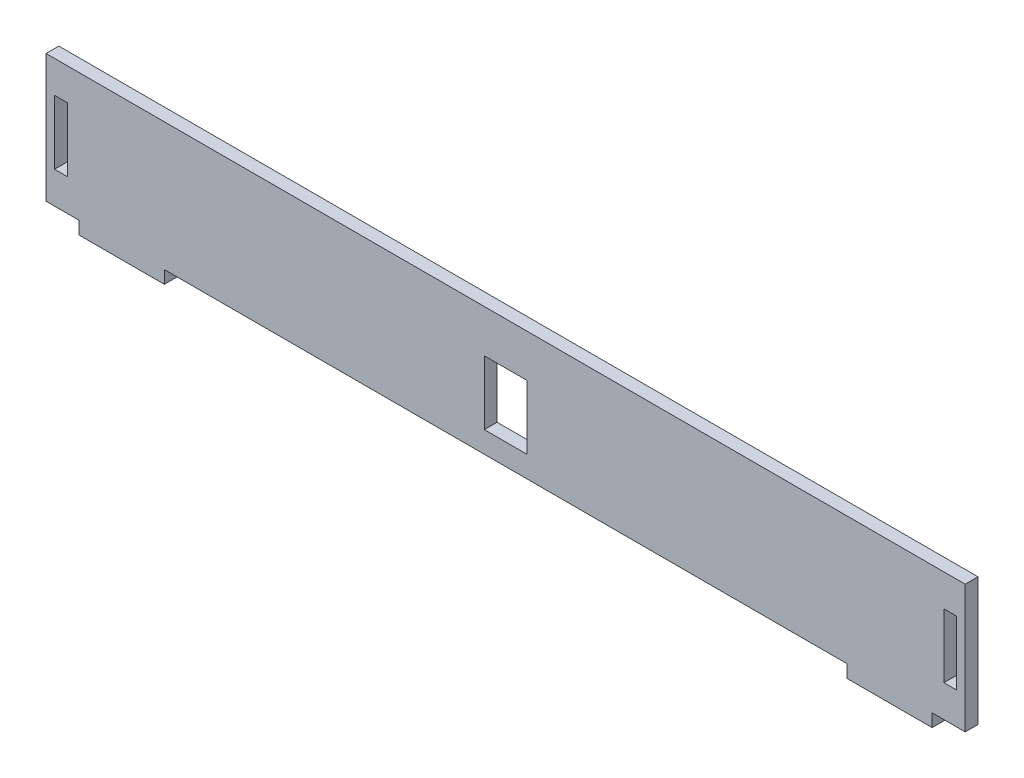
ISO-10303-21;
HEADER;
FILE_DESCRIPTION(('STEP AP214'),'2;1');
FILE_NAME('part.step','',(''),(''),'','','');
FILE_SCHEMA(('AUTOMOTIVE_DESIGN { 1 0 10303 214 1 1 1 1 }'));
ENDSEC;
DATA;
#1=APPLICATION_CONTEXT('core data for automotive mechanical design processes');
#2=APPLICATION_PROTOCOL_DEFINITION('international standard','automotive_design',2000,#1);
#3=PRODUCT_CONTEXT('',#1,'mechanical');
#4=PRODUCT('Part','Part','',(#3));
#5=PRODUCT_RELATED_PRODUCT_CATEGORY('part','',(#4));
#6=PRODUCT_DEFINITION_FORMATION('','',#4);
#7=PRODUCT_DEFINITION_CONTEXT('part definition',#1,'design');
#8=PRODUCT_DEFINITION('design','',#6,#7);
#9=PRODUCT_DEFINITION_SHAPE('','',#8);
#10=(LENGTH_UNIT() NAMED_UNIT(*) SI_UNIT(.MILLI.,.METRE.));
#11=(NAMED_UNIT(*) PLANE_ANGLE_UNIT() SI_UNIT($,.RADIAN.));
#12=(NAMED_UNIT(*) SI_UNIT($,.STERADIAN.) SOLID_ANGLE_UNIT());
#13=UNCERTAINTY_MEASURE_WITH_UNIT(LENGTH_MEASURE(1.E-05),#10,'distance_accuracy_value','');
#14=(GEOMETRIC_REPRESENTATION_CONTEXT(3) GLOBAL_UNCERTAINTY_ASSIGNED_CONTEXT((#13)) GLOBAL_UNIT_ASSIGNED_CONTEXT((#10,
#11,#12)) REPRESENTATION_CONTEXT('',''));
#15=CARTESIAN_POINT('',(0.,0.,0.));
#16=DIRECTION('',(0.,0.,1.));
#17=DIRECTION('',(1.,0.,0.));
#18=AXIS2_PLACEMENT_3D('',#15,#16,#17);
#19=CARTESIAN_POINT('',(0.,0.,3.));
#20=DIRECTION('',(0.,0.,1.));
#21=DIRECTION('',(1.,0.,0.));
#22=AXIS2_PLACEMENT_3D('',#19,#20,#21);
#23=PLANE('',#22);
#24=DIRECTION('',(1.,0.,0.));
#25=VECTOR('',#24,1.);
#26=CARTESIAN_POINT('',(0.,0.,3.));
#27=LINE('',#26,#25);
#28=CARTESIAN_POINT('',(-7.75,0.,3.));
#29=VERTEX_POINT('',#28);
#30=CARTESIAN_POINT('',(0.,0.,3.));
#31=VERTEX_POINT('',#30);
#32=EDGE_CURVE('E335',#29,#31,#27,.T.);
#33=ORIENTED_EDGE('',*,*,#32,.T.);
#34=DIRECTION('',(0.,-1.,0.));
#35=VECTOR('',#34,1.);
#36=CARTESIAN_POINT('',(0.,0.,3.));
#37=LINE('',#36,#35);
#38=CARTESIAN_POINT('',(0.,-3.,3.));
#39=VERTEX_POINT('',#38);
#40=EDGE_CURVE('E339',#31,#39,#37,.T.);
#41=ORIENTED_EDGE('',*,*,#40,.T.);
#42=DIRECTION('',(1.,0.,0.));
#43=VECTOR('',#42,1.);
#44=CARTESIAN_POINT('',(0.,-3.,3.));
#45=LINE('',#44,#43);
#46=CARTESIAN_POINT('',(20.,-3.,3.));
#47=VERTEX_POINT('',#46);
#48=EDGE_CURVE('E343',#39,#47,#45,.T.);
#49=ORIENTED_EDGE('',*,*,#48,.T.);
#50=DIRECTION('',(0.,1.,0.));
#51=VECTOR('',#50,1.);
#52=CARTESIAN_POINT('',(20.,0.,3.));
#53=LINE('',#52,#51);
#54=CARTESIAN_POINT('',(20.,0.,3.));
#55=VERTEX_POINT('',#54);
#56=EDGE_CURVE('E346',#47,#55,#53,.T.);
#57=ORIENTED_EDGE('',*,*,#56,.T.);
#58=DIRECTION('',(1.,0.,0.));
#59=VECTOR('',#58,1.);
#60=CARTESIAN_POINT('',(20.,0.,3.));
#61=LINE('',#60,#59);
#62=CARTESIAN_POINT('',(180.,0.,3.));
#63=VERTEX_POINT('',#62);
#64=EDGE_CURVE('E349',#55,#63,#61,.T.);
#65=ORIENTED_EDGE('',*,*,#64,.T.);
#66=DIRECTION('',(0.,-1.,0.));
#67=VECTOR('',#66,1.);
#68=CARTESIAN_POINT('',(180.,0.,3.));
#69=LINE('',#68,#67);
#70=CARTESIAN_POINT('',(180.,-3.,3.));
#71=VERTEX_POINT('',#70);
#72=EDGE_CURVE('E352',#63,#71,#69,.T.);
#73=ORIENTED_EDGE('',*,*,#72,.T.);
#74=DIRECTION('',(1.,0.,0.));
#75=VECTOR('',#74,1.);
#76=CARTESIAN_POINT('',(200.,-3.,3.));
#77=LINE('',#76,#75);
#78=CARTESIAN_POINT('',(200.,-3.,3.));
#79=VERTEX_POINT('',#78);
#80=EDGE_CURVE('E355',#71,#79,#77,.T.);
#81=ORIENTED_EDGE('',*,*,#80,.T.);
#82=DIRECTION('',(0.,1.,0.));
#83=VECTOR('',#82,1.);
#84=CARTESIAN_POINT('',(200.,0.,3.));
#85=LINE('',#84,#83);
#86=CARTESIAN_POINT('',(200.,0.,3.));
#87=VERTEX_POINT('',#86);
#88=EDGE_CURVE('E358',#79,#87,#85,.T.);
#89=ORIENTED_EDGE('',*,*,#88,.T.);
#90=DIRECTION('',(1.,0.,0.));
#91=VECTOR('',#90,1.);
#92=CARTESIAN_POINT('',(200.,0.,3.));
#93=LINE('',#92,#91);
#94=CARTESIAN_POINT('',(207.75,0.,3.));
#95=VERTEX_POINT('',#94);
#96=EDGE_CURVE('E361',#87,#95,#93,.T.);
#97=ORIENTED_EDGE('',*,*,#96,.T.);
#98=DIRECTION('',(0.,1.,0.));
#99=VECTOR('',#98,1.);
#100=CARTESIAN_POINT('',(207.75,30.,3.));
#101=LINE('',#100,#99);
#102=CARTESIAN_POINT('',(207.75,30.,3.));
#103=VERTEX_POINT('',#102);
#104=EDGE_CURVE('E364',#95,#103,#101,.T.);
#105=ORIENTED_EDGE('',*,*,#104,.T.);
#106=DIRECTION('',(-1.,0.,0.));
#107=VECTOR('',#106,1.);
#108=CARTESIAN_POINT('',(202.75,30.,3.));
#109=LINE('',#108,#107);
#110=CARTESIAN_POINT('',(-7.75,30.,3.));
#111=VERTEX_POINT('',#110);
#112=EDGE_CURVE('E367',#103,#111,#109,.T.);
#113=ORIENTED_EDGE('',*,*,#112,.T.);
#114=DIRECTION('',(0.,-1.,0.));
#115=VECTOR('',#114,1.);
#116=CARTESIAN_POINT('',(-7.75,30.,3.));
#117=LINE('',#116,#115);
#118=EDGE_CURVE('E370',#111,#29,#117,.T.);
#119=ORIENTED_EDGE('',*,*,#118,.T.);
#120=EDGE_LOOP('',(#33,#41,#49,#57,#65,#73,#81,#89,#97,#105,#113,#119));
#121=FACE_BOUND('',#120,.T.);
#122=DIRECTION('',(0.,-1.,0.));
#123=VECTOR('',#122,1.);
#124=CARTESIAN_POINT('',(202.75,22.5,3.));
#125=LINE('',#124,#123);
#126=CARTESIAN_POINT('',(202.75,22.5,3.));
#127=VERTEX_POINT('',#126);
#128=CARTESIAN_POINT('',(202.75,7.5,3.));
#129=VERTEX_POINT('',#128);
#130=EDGE_CURVE('E295',#127,#129,#125,.T.);
#131=ORIENTED_EDGE('',*,*,#130,.F.);
#132=DIRECTION('',(-1.,0.,0.));
#133=VECTOR('',#132,1.);
#134=CARTESIAN_POINT('',(202.75,22.5,3.));
#135=LINE('',#134,#133);
#136=CARTESIAN_POINT('',(205.75,22.5,3.));
#137=VERTEX_POINT('',#136);
#138=EDGE_CURVE('E292',#137,#127,#135,.T.);
#139=ORIENTED_EDGE('',*,*,#138,.F.);
#140=DIRECTION('',(0.,1.,0.));
#141=VECTOR('',#140,1.);
#142=CARTESIAN_POINT('',(205.75,22.5,3.));
#143=LINE('',#142,#141);
#144=CARTESIAN_POINT('',(205.75,7.5,3.));
#145=VERTEX_POINT('',#144);
#146=EDGE_CURVE('E303',#145,#137,#143,.T.);
#147=ORIENTED_EDGE('',*,*,#146,.F.);
#148=DIRECTION('',(1.,0.,0.));
#149=VECTOR('',#148,1.);
#150=CARTESIAN_POINT('',(205.75,7.5,3.));
#151=LINE('',#150,#149);
#152=EDGE_CURVE('E299',#129,#145,#151,.T.);
#153=ORIENTED_EDGE('',*,*,#152,.F.);
#154=EDGE_LOOP('',(#131,#139,#147,#153));
#155=FACE_BOUND('',#154,.T.);
#156=DIRECTION('',(0.,-1.,0.));
#157=VECTOR('',#156,1.);
#158=CARTESIAN_POINT('',(-5.75,22.5,3.));
#159=LINE('',#158,#157);
#160=CARTESIAN_POINT('',(-5.75,22.5,3.));
#161=VERTEX_POINT('',#160);
#162=CARTESIAN_POINT('',(-5.75,7.5,3.));
#163=VERTEX_POINT('',#162);
#164=EDGE_CURVE('E252',#161,#163,#159,.T.);
#165=ORIENTED_EDGE('',*,*,#164,.F.);
#166=DIRECTION('',(-1.,0.,0.));
#167=VECTOR('',#166,1.);
#168=CARTESIAN_POINT('',(-2.75,22.5,3.));
#169=LINE('',#168,#167);
#170=CARTESIAN_POINT('',(-2.75,22.5,3.));
#171=VERTEX_POINT('',#170);
#172=EDGE_CURVE('E249',#171,#161,#169,.T.);
#173=ORIENTED_EDGE('',*,*,#172,.F.);
#174=DIRECTION('',(0.,1.,0.));
#175=VECTOR('',#174,1.);
#176=CARTESIAN_POINT('',(-2.75,22.5,3.));
#177=LINE('',#176,#175);
#178=CARTESIAN_POINT('',(-2.75,7.5,3.));
#179=VERTEX_POINT('',#178);
#180=EDGE_CURVE('E260',#179,#171,#177,.T.);
#181=ORIENTED_EDGE('',*,*,#180,.F.);
#182=DIRECTION('',(1.,0.,0.));
#183=VECTOR('',#182,1.);
#184=CARTESIAN_POINT('',(-5.75,7.5,3.));
#185=LINE('',#184,#183);
#186=EDGE_CURVE('E256',#163,#179,#185,.T.);
#187=ORIENTED_EDGE('',*,*,#186,.F.);
#188=EDGE_LOOP('',(#165,#173,#181,#187));
#189=FACE_BOUND('',#188,.T.);
#190=DIRECTION('',(0.,1.,0.));
#191=VECTOR('',#190,1.);
#192=CARTESIAN_POINT('',(105.,5.,3.));
#193=LINE('',#192,#191);
#194=CARTESIAN_POINT('',(105.,5.,3.));
#195=VERTEX_POINT('',#194);
#196=CARTESIAN_POINT('',(105.,20.,3.));
#197=VERTEX_POINT('',#196);
#198=EDGE_CURVE('E208',#195,#197,#193,.T.);
#199=ORIENTED_EDGE('',*,*,#198,.F.);
#200=DIRECTION('',(1.,0.,0.));
#201=VECTOR('',#200,1.);
#202=CARTESIAN_POINT('',(95.,5.,3.));
#203=LINE('',#202,#201);
#204=CARTESIAN_POINT('',(95.,5.,3.));
#205=VERTEX_POINT('',#204);
#206=EDGE_CURVE('E199',#205,#195,#203,.T.);
#207=ORIENTED_EDGE('',*,*,#206,.F.);
#208=DIRECTION('',(0.,-1.,0.));
#209=VECTOR('',#208,1.);
#210=CARTESIAN_POINT('',(95.,20.,3.));
#211=LINE('',#210,#209);
#212=CARTESIAN_POINT('',(95.,20.,3.));
#213=VERTEX_POINT('',#212);
#214=EDGE_CURVE('E226',#213,#205,#211,.T.);
#215=ORIENTED_EDGE('',*,*,#214,.F.);
#216=DIRECTION('',(-1.,0.,0.));
#217=VECTOR('',#216,1.);
#218=CARTESIAN_POINT('',(105.,20.,3.));
#219=LINE('',#218,#217);
#220=EDGE_CURVE('E222',#197,#213,#219,.T.);
#221=ORIENTED_EDGE('',*,*,#220,.F.);
#222=EDGE_LOOP('',(#199,#207,#215,#221));
#223=FACE_BOUND('',#222,.T.);
#224=ADVANCED_FACE('F39',(#121,#155,#189,#223),#23,.T.);
#225=CARTESIAN_POINT('',(0.,0.,0.));
#226=DIRECTION('',(0.,0.,1.));
#227=DIRECTION('',(1.,0.,0.));
#228=AXIS2_PLACEMENT_3D('',#225,#226,#227);
#229=PLANE('',#228);
#230=DIRECTION('',(-1.,0.,0.));
#231=VECTOR('',#230,1.);
#232=CARTESIAN_POINT('',(-2.75,22.5,0.));
#233=LINE('',#232,#231);
#234=CARTESIAN_POINT('',(-2.75,22.5,0.));
#235=VERTEX_POINT('',#234);
#236=CARTESIAN_POINT('',(-5.75,22.5,0.));
#237=VERTEX_POINT('',#236);
#238=EDGE_CURVE('E218',#235,#237,#233,.T.);
#239=ORIENTED_EDGE('',*,*,#238,.T.);
#240=DIRECTION('',(0.,-1.,0.));
#241=VECTOR('',#240,1.);
#242=CARTESIAN_POINT('',(-5.75,22.5,0.));
#243=LINE('',#242,#241);
#244=CARTESIAN_POINT('',(-5.75,7.5,0.));
#245=VERTEX_POINT('',#244);
#246=EDGE_CURVE('E267',#237,#245,#243,.T.);
#247=ORIENTED_EDGE('',*,*,#246,.T.);
#248=DIRECTION('',(1.,0.,0.));
#249=VECTOR('',#248,1.);
#250=CARTESIAN_POINT('',(-5.75,7.5,0.));
#251=LINE('',#250,#249);
#252=CARTESIAN_POINT('',(-2.75,7.5,0.));
#253=VERTEX_POINT('',#252);
#254=EDGE_CURVE('E271',#245,#253,#251,.T.);
#255=ORIENTED_EDGE('',*,*,#254,.T.);
#256=DIRECTION('',(0.,1.,0.));
#257=VECTOR('',#256,1.);
#258=CARTESIAN_POINT('',(-2.75,22.5,0.));
#259=LINE('',#258,#257);
#260=EDGE_CURVE('E253',#253,#235,#259,.T.);
#261=ORIENTED_EDGE('',*,*,#260,.T.);
#262=EDGE_LOOP('',(#239,#247,#255,#261));
#263=FACE_BOUND('',#262,.T.);
#264=DIRECTION('',(0.,-1.,0.));
#265=VECTOR('',#264,1.);
#266=CARTESIAN_POINT('',(0.,0.,0.));
#267=LINE('',#266,#265);
#268=CARTESIAN_POINT('',(0.,0.,0.));
#269=VERTEX_POINT('',#268);
#270=CARTESIAN_POINT('',(0.,-3.,0.));
#271=VERTEX_POINT('',#270);
#272=EDGE_CURVE('E334',#269,#271,#267,.T.);
#273=ORIENTED_EDGE('',*,*,#272,.F.);
#274=DIRECTION('',(1.,0.,0.));
#275=VECTOR('',#274,1.);
#276=CARTESIAN_POINT('',(-2.75,0.,0.));
#277=LINE('',#276,#275);
#278=CARTESIAN_POINT('',(-7.75,0.,0.));
#279=VERTEX_POINT('',#278);
#280=EDGE_CURVE('E340',#279,#269,#277,.T.);
#281=ORIENTED_EDGE('',*,*,#280,.F.);
#282=DIRECTION('',(0.,-1.,0.));
#283=VECTOR('',#282,1.);
#284=CARTESIAN_POINT('',(-7.75,30.,0.));
#285=LINE('',#284,#283);
#286=CARTESIAN_POINT('',(-7.75,30.,0.));
#287=VERTEX_POINT('',#286);
#288=EDGE_CURVE('E406',#287,#279,#285,.T.);
#289=ORIENTED_EDGE('',*,*,#288,.F.);
#290=DIRECTION('',(-1.,0.,0.));
#291=VECTOR('',#290,1.);
#292=CARTESIAN_POINT('',(-2.75,30.,0.));
#293=LINE('',#292,#291);
#294=CARTESIAN_POINT('',(207.75,30.,0.));
#295=VERTEX_POINT('',#294);
#296=EDGE_CURVE('E403',#295,#287,#293,.T.);
#297=ORIENTED_EDGE('',*,*,#296,.F.);
#298=DIRECTION('',(0.,1.,0.));
#299=VECTOR('',#298,1.);
#300=CARTESIAN_POINT('',(207.75,30.,0.));
#301=LINE('',#300,#299);
#302=CARTESIAN_POINT('',(207.75,0.,0.));
#303=VERTEX_POINT('',#302);
#304=EDGE_CURVE('E399',#303,#295,#301,.T.);
#305=ORIENTED_EDGE('',*,*,#304,.F.);
#306=DIRECTION('',(1.,0.,0.));
#307=VECTOR('',#306,1.);
#308=CARTESIAN_POINT('',(202.75,0.,0.));
#309=LINE('',#308,#307);
#310=CARTESIAN_POINT('',(200.,0.,0.));
#311=VERTEX_POINT('',#310);
#312=EDGE_CURVE('E396',#311,#303,#309,.T.);
#313=ORIENTED_EDGE('',*,*,#312,.F.);
#314=DIRECTION('',(0.,1.,0.));
#315=VECTOR('',#314,1.);
#316=CARTESIAN_POINT('',(200.,0.,0.));
#317=LINE('',#316,#315);
#318=CARTESIAN_POINT('',(200.,-3.,0.));
#319=VERTEX_POINT('',#318);
#320=EDGE_CURVE('E392',#319,#311,#317,.T.);
#321=ORIENTED_EDGE('',*,*,#320,.F.);
#322=DIRECTION('',(1.,0.,0.));
#323=VECTOR('',#322,1.);
#324=CARTESIAN_POINT('',(200.,-3.,0.));
#325=LINE('',#324,#323);
#326=CARTESIAN_POINT('',(180.,-3.,0.));
#327=VERTEX_POINT('',#326);
#328=EDGE_CURVE('E389',#327,#319,#325,.T.);
#329=ORIENTED_EDGE('',*,*,#328,.F.);
#330=DIRECTION('',(0.,-1.,0.));
#331=VECTOR('',#330,1.);
#332=CARTESIAN_POINT('',(180.,0.,0.));
#333=LINE('',#332,#331);
#334=CARTESIAN_POINT('',(180.,0.,0.));
#335=VERTEX_POINT('',#334);
#336=EDGE_CURVE('E386',#335,#327,#333,.T.);
#337=ORIENTED_EDGE('',*,*,#336,.F.);
#338=DIRECTION('',(1.,0.,0.));
#339=VECTOR('',#338,1.);
#340=CARTESIAN_POINT('',(20.,0.,0.));
#341=LINE('',#340,#339);
#342=CARTESIAN_POINT('',(20.,0.,0.));
#343=VERTEX_POINT('',#342);
#344=EDGE_CURVE('E383',#343,#335,#341,.T.);
#345=ORIENTED_EDGE('',*,*,#344,.F.);
#346=DIRECTION('',(0.,1.,0.));
#347=VECTOR('',#346,1.);
#348=CARTESIAN_POINT('',(20.,0.,0.));
#349=LINE('',#348,#347);
#350=CARTESIAN_POINT('',(20.,-3.,0.));
#351=VERTEX_POINT('',#350);
#352=EDGE_CURVE('E380',#351,#343,#349,.T.);
#353=ORIENTED_EDGE('',*,*,#352,.F.);
#354=DIRECTION('',(1.,0.,0.));
#355=VECTOR('',#354,1.);
#356=CARTESIAN_POINT('',(0.,-3.,0.));
#357=LINE('',#356,#355);
#358=EDGE_CURVE('E377',#271,#351,#357,.T.);
#359=ORIENTED_EDGE('',*,*,#358,.F.);
#360=EDGE_LOOP('',(#273,#281,#289,#297,#305,#313,#321,#329,#337,#345,#353,#359));
#361=FACE_BOUND('',#360,.T.);
#362=DIRECTION('',(-1.,0.,0.));
#363=VECTOR('',#362,1.);
#364=CARTESIAN_POINT('',(202.75,22.5,0.));
#365=LINE('',#364,#363);
#366=CARTESIAN_POINT('',(205.75,22.5,0.));
#367=VERTEX_POINT('',#366);
#368=CARTESIAN_POINT('',(202.75,22.5,0.));
#369=VERTEX_POINT('',#368);
#370=EDGE_CURVE('E291',#367,#369,#365,.T.);
#371=ORIENTED_EDGE('',*,*,#370,.T.);
#372=DIRECTION('',(0.,-1.,0.));
#373=VECTOR('',#372,1.);
#374=CARTESIAN_POINT('',(202.75,22.5,0.));
#375=LINE('',#374,#373);
#376=CARTESIAN_POINT('',(202.75,7.5,0.));
#377=VERTEX_POINT('',#376);
#378=EDGE_CURVE('E310',#369,#377,#375,.T.);
#379=ORIENTED_EDGE('',*,*,#378,.T.);
#380=DIRECTION('',(1.,0.,0.));
#381=VECTOR('',#380,1.);
#382=CARTESIAN_POINT('',(205.75,7.5,0.));
#383=LINE('',#382,#381);
#384=CARTESIAN_POINT('',(205.75,7.5,0.));
#385=VERTEX_POINT('',#384);
#386=EDGE_CURVE('E314',#377,#385,#383,.T.);
#387=ORIENTED_EDGE('',*,*,#386,.T.);
#388=DIRECTION('',(0.,1.,0.));
#389=VECTOR('',#388,1.);
#390=CARTESIAN_POINT('',(205.75,22.5,0.));
#391=LINE('',#390,#389);
#392=EDGE_CURVE('E296',#385,#367,#391,.T.);
#393=ORIENTED_EDGE('',*,*,#392,.T.);
#394=EDGE_LOOP('',(#371,#379,#387,#393));
#395=FACE_BOUND('',#394,.T.);
#396=DIRECTION('',(1.,0.,0.));
#397=VECTOR('',#396,1.);
#398=CARTESIAN_POINT('',(100.,5.,0.));
#399=LINE('',#398,#397);
#400=CARTESIAN_POINT('',(95.,5.,0.));
#401=VERTEX_POINT('',#400);
#402=CARTESIAN_POINT('',(105.,5.,0.));
#403=VERTEX_POINT('',#402);
#404=EDGE_CURVE('E231',#401,#403,#399,.T.);
#405=ORIENTED_EDGE('',*,*,#404,.T.);
#406=DIRECTION('',(0.,1.,0.));
#407=VECTOR('',#406,1.);
#408=CARTESIAN_POINT('',(105.,5.,0.));
#409=LINE('',#408,#407);
#410=CARTESIAN_POINT('',(105.,20.,0.));
#411=VERTEX_POINT('',#410);
#412=EDGE_CURVE('E215',#403,#411,#409,.T.);
#413=ORIENTED_EDGE('',*,*,#412,.T.);
#414=DIRECTION('',(-1.,0.,0.));
#415=VECTOR('',#414,1.);
#416=CARTESIAN_POINT('',(105.,20.,0.));
#417=LINE('',#416,#415);
#418=CARTESIAN_POINT('',(95.,20.,0.));
#419=VERTEX_POINT('',#418);
#420=EDGE_CURVE('E236',#411,#419,#417,.T.);
#421=ORIENTED_EDGE('',*,*,#420,.T.);
#422=DIRECTION('',(0.,-1.,0.));
#423=VECTOR('',#422,1.);
#424=CARTESIAN_POINT('',(95.,20.,0.));
#425=LINE('',#424,#423);
#426=EDGE_CURVE('E209',#419,#401,#425,.T.);
#427=ORIENTED_EDGE('',*,*,#426,.T.);
#428=EDGE_LOOP('',(#405,#413,#421,#427));
#429=FACE_BOUND('',#428,.T.);
#430=ADVANCED_FACE('F461',(#263,#361,#395,#429),#229,.F.);
#431=CARTESIAN_POINT('',(0.,0.,3.));
#432=DIRECTION('',(1.,0.,0.));
#433=DIRECTION('',(0.,0.,-1.));
#434=AXIS2_PLACEMENT_3D('',#431,#432,#433);
#435=PLANE('',#434);
#436=ORIENTED_EDGE('',*,*,#272,.T.);
#437=DIRECTION('',(0.,0.,-1.));
#438=VECTOR('',#437,1.);
#439=CARTESIAN_POINT('',(0.,-3.,3.));
#440=LINE('',#439,#438);
#441=EDGE_CURVE('E48',#39,#271,#440,.T.);
#442=ORIENTED_EDGE('',*,*,#441,.F.);
#443=ORIENTED_EDGE('',*,*,#40,.F.);
#444=DIRECTION('',(0.,0.,-1.));
#445=VECTOR('',#444,1.);
#446=CARTESIAN_POINT('',(0.,0.,3.));
#447=LINE('',#446,#445);
#448=EDGE_CURVE('E11',#31,#269,#447,.T.);
#449=ORIENTED_EDGE('',*,*,#448,.T.);
#450=EDGE_LOOP('',(#436,#442,#443,#449));
#451=FACE_BOUND('',#450,.T.);
#452=ADVANCED_FACE('F41',(#451),#435,.F.);
#453=CARTESIAN_POINT('',(0.,-3.,3.));
#454=DIRECTION('',(0.,1.,0.));
#455=DIRECTION('',(0.,0.,1.));
#456=AXIS2_PLACEMENT_3D('',#453,#454,#455);
#457=PLANE('',#456);
#458=ORIENTED_EDGE('',*,*,#358,.T.);
#459=DIRECTION('',(0.,0.,-1.));
#460=VECTOR('',#459,1.);
#461=CARTESIAN_POINT('',(20.,-3.,3.));
#462=LINE('',#461,#460);
#463=EDGE_CURVE('E446',#47,#351,#462,.T.);
#464=ORIENTED_EDGE('',*,*,#463,.F.);
#465=ORIENTED_EDGE('',*,*,#48,.F.);
#466=ORIENTED_EDGE('',*,*,#441,.T.);
#467=EDGE_LOOP('',(#458,#464,#465,#466));
#468=FACE_BOUND('',#467,.T.);
#469=ADVANCED_FACE('F455',(#468),#457,.F.);
#470=CARTESIAN_POINT('',(20.,0.,3.));
#471=DIRECTION('',(-1.,0.,0.));
#472=DIRECTION('',(0.,0.,1.));
#473=AXIS2_PLACEMENT_3D('',#470,#471,#472);
#474=PLANE('',#473);
#475=ORIENTED_EDGE('',*,*,#352,.T.);
#476=DIRECTION('',(0.,0.,-1.));
#477=VECTOR('',#476,1.);
#478=CARTESIAN_POINT('',(20.,0.,3.));
#479=LINE('',#478,#477);
#480=EDGE_CURVE('E442',#55,#343,#479,.T.);
#481=ORIENTED_EDGE('',*,*,#480,.F.);
#482=ORIENTED_EDGE('',*,*,#56,.F.);
#483=ORIENTED_EDGE('',*,*,#463,.T.);
#484=EDGE_LOOP('',(#475,#481,#482,#483));
#485=FACE_BOUND('',#484,.T.);
#486=ADVANCED_FACE('F468',(#485),#474,.F.);
#487=CARTESIAN_POINT('',(20.,0.,3.));
#488=DIRECTION('',(0.,1.,0.));
#489=DIRECTION('',(0.,0.,1.));
#490=AXIS2_PLACEMENT_3D('',#487,#488,#489);
#491=PLANE('',#490);
#492=ORIENTED_EDGE('',*,*,#344,.T.);
#493=DIRECTION('',(0.,0.,-1.));
#494=VECTOR('',#493,1.);
#495=CARTESIAN_POINT('',(180.,0.,3.));
#496=LINE('',#495,#494);
#497=EDGE_CURVE('E438',#63,#335,#496,.T.);
#498=ORIENTED_EDGE('',*,*,#497,.F.);
#499=ORIENTED_EDGE('',*,*,#64,.F.);
#500=ORIENTED_EDGE('',*,*,#480,.T.);
#501=EDGE_LOOP('',(#492,#498,#499,#500));
#502=FACE_BOUND('',#501,.T.);
#503=ADVANCED_FACE('F472',(#502),#491,.F.);
#504=CARTESIAN_POINT('',(180.,0.,3.));
#505=DIRECTION('',(1.,0.,0.));
#506=DIRECTION('',(0.,0.,-1.));
#507=AXIS2_PLACEMENT_3D('',#504,#505,#506);
#508=PLANE('',#507);
#509=ORIENTED_EDGE('',*,*,#336,.T.);
#510=DIRECTION('',(0.,0.,-1.));
#511=VECTOR('',#510,1.);
#512=CARTESIAN_POINT('',(180.,-3.,3.));
#513=LINE('',#512,#511);
#514=EDGE_CURVE('E434',#71,#327,#513,.T.);
#515=ORIENTED_EDGE('',*,*,#514,.F.);
#516=ORIENTED_EDGE('',*,*,#72,.F.);
#517=ORIENTED_EDGE('',*,*,#497,.T.);
#518=EDGE_LOOP('',(#509,#515,#516,#517));
#519=FACE_BOUND('',#518,.T.);
#520=ADVANCED_FACE('F510',(#519),#508,.F.);
#521=CARTESIAN_POINT('',(200.,-3.,3.));
#522=DIRECTION('',(0.,1.,0.));
#523=DIRECTION('',(0.,0.,1.));
#524=AXIS2_PLACEMENT_3D('',#521,#522,#523);
#525=PLANE('',#524);
#526=ORIENTED_EDGE('',*,*,#328,.T.);
#527=DIRECTION('',(0.,0.,-1.));
#528=VECTOR('',#527,1.);
#529=CARTESIAN_POINT('',(200.,-3.,3.));
#530=LINE('',#529,#528);
#531=EDGE_CURVE('E430',#79,#319,#530,.T.);
#532=ORIENTED_EDGE('',*,*,#531,.F.);
#533=ORIENTED_EDGE('',*,*,#80,.F.);
#534=ORIENTED_EDGE('',*,*,#514,.T.);
#535=EDGE_LOOP('',(#526,#532,#533,#534));
#536=FACE_BOUND('',#535,.T.);
#537=ADVANCED_FACE('F508',(#536),#525,.F.);
#538=CARTESIAN_POINT('',(200.,0.,3.));
#539=DIRECTION('',(-1.,0.,0.));
#540=DIRECTION('',(0.,0.,1.));
#541=AXIS2_PLACEMENT_3D('',#538,#539,#540);
#542=PLANE('',#541);
#543=ORIENTED_EDGE('',*,*,#320,.T.);
#544=DIRECTION('',(0.,0.,-1.));
#545=VECTOR('',#544,1.);
#546=CARTESIAN_POINT('',(200.,0.,3.));
#547=LINE('',#546,#545);
#548=EDGE_CURVE('E426',#87,#311,#547,.T.);
#549=ORIENTED_EDGE('',*,*,#548,.F.);
#550=ORIENTED_EDGE('',*,*,#88,.F.);
#551=ORIENTED_EDGE('',*,*,#531,.T.);
#552=EDGE_LOOP('',(#543,#549,#550,#551));
#553=FACE_BOUND('',#552,.T.);
#554=ADVANCED_FACE('F501',(#553),#542,.F.);
#555=CARTESIAN_POINT('',(202.75,0.,3.));
#556=DIRECTION('',(0.,1.,0.));
#557=DIRECTION('',(0.,0.,1.));
#558=AXIS2_PLACEMENT_3D('',#555,#556,#557);
#559=PLANE('',#558);
#560=ORIENTED_EDGE('',*,*,#312,.T.);
#561=DIRECTION('',(0.,0.,-1.));
#562=VECTOR('',#561,1.);
#563=CARTESIAN_POINT('',(207.75,0.,3.));
#564=LINE('',#563,#562);
#565=EDGE_CURVE('E422',#95,#303,#564,.T.);
#566=ORIENTED_EDGE('',*,*,#565,.F.);
#567=ORIENTED_EDGE('',*,*,#96,.F.);
#568=ORIENTED_EDGE('',*,*,#548,.T.);
#569=EDGE_LOOP('',(#560,#566,#567,#568));
#570=FACE_BOUND('',#569,.T.);
#571=ADVANCED_FACE('F505',(#570),#559,.F.);
#572=CARTESIAN_POINT('',(207.75,30.,3.));
#573=DIRECTION('',(-1.,0.,0.));
#574=DIRECTION('',(0.,0.,1.));
#575=AXIS2_PLACEMENT_3D('',#572,#573,#574);
#576=PLANE('',#575);
#577=ORIENTED_EDGE('',*,*,#304,.T.);
#578=DIRECTION('',(0.,0.,-1.));
#579=VECTOR('',#578,1.);
#580=CARTESIAN_POINT('',(207.75,30.,3.));
#581=LINE('',#580,#579);
#582=EDGE_CURVE('E418',#103,#295,#581,.T.);
#583=ORIENTED_EDGE('',*,*,#582,.F.);
#584=ORIENTED_EDGE('',*,*,#104,.F.);
#585=ORIENTED_EDGE('',*,*,#565,.T.);
#586=EDGE_LOOP('',(#577,#583,#584,#585));
#587=FACE_BOUND('',#586,.T.);
#588=ADVANCED_FACE('F494',(#587),#576,.F.);
#589=CARTESIAN_POINT('',(-2.75,30.,3.));
#590=DIRECTION('',(0.,-1.,0.));
#591=DIRECTION('',(0.,0.,-1.));
#592=AXIS2_PLACEMENT_3D('',#589,#590,#591);
#593=PLANE('',#592);
#594=ORIENTED_EDGE('',*,*,#296,.T.);
#595=DIRECTION('',(0.,0.,-1.));
#596=VECTOR('',#595,1.);
#597=CARTESIAN_POINT('',(-7.75,30.,3.));
#598=LINE('',#597,#596);
#599=EDGE_CURVE('E414',#111,#287,#598,.T.);
#600=ORIENTED_EDGE('',*,*,#599,.F.);
#601=ORIENTED_EDGE('',*,*,#112,.F.);
#602=ORIENTED_EDGE('',*,*,#582,.T.);
#603=EDGE_LOOP('',(#594,#600,#601,#602));
#604=FACE_BOUND('',#603,.T.);
#605=ADVANCED_FACE('F490',(#604),#593,.F.);
#606=CARTESIAN_POINT('',(-7.75,30.,3.));
#607=DIRECTION('',(1.,0.,0.));
#608=DIRECTION('',(0.,0.,-1.));
#609=AXIS2_PLACEMENT_3D('',#606,#607,#608);
#610=PLANE('',#609);
#611=ORIENTED_EDGE('',*,*,#288,.T.);
#612=DIRECTION('',(0.,0.,-1.));
#613=VECTOR('',#612,1.);
#614=CARTESIAN_POINT('',(-7.75,0.,3.));
#615=LINE('',#614,#613);
#616=EDGE_CURVE('E374',#29,#279,#615,.T.);
#617=ORIENTED_EDGE('',*,*,#616,.F.);
#618=ORIENTED_EDGE('',*,*,#118,.F.);
#619=ORIENTED_EDGE('',*,*,#599,.T.);
#620=EDGE_LOOP('',(#611,#617,#618,#619));
#621=FACE_BOUND('',#620,.T.);
#622=ADVANCED_FACE('F485',(#621),#610,.F.);
#623=CARTESIAN_POINT('',(-2.75,0.,3.));
#624=DIRECTION('',(0.,1.,0.));
#625=DIRECTION('',(-1.,0.,0.));
#626=AXIS2_PLACEMENT_3D('',#623,#624,#625);
#627=PLANE('',#626);
#628=ORIENTED_EDGE('',*,*,#280,.T.);
#629=ORIENTED_EDGE('',*,*,#448,.F.);
#630=ORIENTED_EDGE('',*,*,#32,.F.);
#631=ORIENTED_EDGE('',*,*,#616,.T.);
#632=EDGE_LOOP('',(#628,#629,#630,#631));
#633=FACE_BOUND('',#632,.T.);
#634=ADVANCED_FACE('F480',(#633),#627,.F.);
#635=CARTESIAN_POINT('',(202.75,22.5,3.));
#636=DIRECTION('',(0.,-1.,0.));
#637=DIRECTION('',(0.,0.,-1.));
#638=AXIS2_PLACEMENT_3D('',#635,#636,#637);
#639=PLANE('',#638);
#640=ORIENTED_EDGE('',*,*,#370,.F.);
#641=DIRECTION('',(0.,0.,-1.));
#642=VECTOR('',#641,1.);
#643=CARTESIAN_POINT('',(205.75,22.5,3.));
#644=LINE('',#643,#642);
#645=EDGE_CURVE('E306',#137,#367,#644,.T.);
#646=ORIENTED_EDGE('',*,*,#645,.F.);
#647=ORIENTED_EDGE('',*,*,#138,.T.);
#648=DIRECTION('',(0.,0.,-1.));
#649=VECTOR('',#648,1.);
#650=CARTESIAN_POINT('',(202.75,22.5,3.));
#651=LINE('',#650,#649);
#652=EDGE_CURVE('E330',#127,#369,#651,.T.);
#653=ORIENTED_EDGE('',*,*,#652,.T.);
#654=EDGE_LOOP('',(#640,#646,#647,#653));
#655=FACE_BOUND('',#654,.T.);
#656=ADVANCED_FACE('F527',(#655),#639,.T.);
#657=CARTESIAN_POINT('',(202.75,22.5,3.));
#658=DIRECTION('',(1.,0.,0.));
#659=DIRECTION('',(0.,0.,-1.));
#660=AXIS2_PLACEMENT_3D('',#657,#658,#659);
#661=PLANE('',#660);
#662=ORIENTED_EDGE('',*,*,#378,.F.);
#663=ORIENTED_EDGE('',*,*,#652,.F.);
#664=ORIENTED_EDGE('',*,*,#130,.T.);
#665=DIRECTION('',(0.,0.,-1.));
#666=VECTOR('',#665,1.);
#667=CARTESIAN_POINT('',(202.75,7.5,3.));
#668=LINE('',#667,#666);
#669=EDGE_CURVE('E327',#129,#377,#668,.T.);
#670=ORIENTED_EDGE('',*,*,#669,.T.);
#671=EDGE_LOOP('',(#662,#663,#664,#670));
#672=FACE_BOUND('',#671,.T.);
#673=ADVANCED_FACE('F571',(#672),#661,.T.);
#674=CARTESIAN_POINT('',(205.75,7.5,3.));
#675=DIRECTION('',(0.,1.,0.));
#676=DIRECTION('',(-1.,0.,0.));
#677=AXIS2_PLACEMENT_3D('',#674,#675,#676);
#678=PLANE('',#677);
#679=ORIENTED_EDGE('',*,*,#386,.F.);
#680=ORIENTED_EDGE('',*,*,#669,.F.);
#681=ORIENTED_EDGE('',*,*,#152,.T.);
#682=DIRECTION('',(0.,0.,-1.));
#683=VECTOR('',#682,1.);
#684=CARTESIAN_POINT('',(205.75,7.5,3.));
#685=LINE('',#684,#683);
#686=EDGE_CURVE('E324',#145,#385,#685,.T.);
#687=ORIENTED_EDGE('',*,*,#686,.T.);
#688=EDGE_LOOP('',(#679,#680,#681,#687));
#689=FACE_BOUND('',#688,.T.);
#690=ADVANCED_FACE('F578',(#689),#678,.T.);
#691=CARTESIAN_POINT('',(205.75,22.5,3.));
#692=DIRECTION('',(-1.,0.,0.));
#693=DIRECTION('',(0.,0.,1.));
#694=AXIS2_PLACEMENT_3D('',#691,#692,#693);
#695=PLANE('',#694);
#696=ORIENTED_EDGE('',*,*,#392,.F.);
#697=ORIENTED_EDGE('',*,*,#686,.F.);
#698=ORIENTED_EDGE('',*,*,#146,.T.);
#699=ORIENTED_EDGE('',*,*,#645,.T.);
#700=EDGE_LOOP('',(#696,#697,#698,#699));
#701=FACE_BOUND('',#700,.T.);
#702=ADVANCED_FACE('F585',(#701),#695,.T.);
#703=CARTESIAN_POINT('',(-2.75,22.5,3.));
#704=DIRECTION('',(0.,-1.,0.));
#705=DIRECTION('',(0.,0.,-1.));
#706=AXIS2_PLACEMENT_3D('',#703,#704,#705);
#707=PLANE('',#706);
#708=ORIENTED_EDGE('',*,*,#238,.F.);
#709=DIRECTION('',(0.,0.,-1.));
#710=VECTOR('',#709,1.);
#711=CARTESIAN_POINT('',(-2.75,22.5,3.));
#712=LINE('',#711,#710);
#713=EDGE_CURVE('E263',#171,#235,#712,.T.);
#714=ORIENTED_EDGE('',*,*,#713,.F.);
#715=ORIENTED_EDGE('',*,*,#172,.T.);
#716=DIRECTION('',(0.,0.,-1.));
#717=VECTOR('',#716,1.);
#718=CARTESIAN_POINT('',(-5.75,22.5,3.));
#719=LINE('',#718,#717);
#720=EDGE_CURVE('E287',#161,#237,#719,.T.);
#721=ORIENTED_EDGE('',*,*,#720,.T.);
#722=EDGE_LOOP('',(#708,#714,#715,#721));
#723=FACE_BOUND('',#722,.T.);
#724=ADVANCED_FACE('F593',(#723),#707,.T.);
#725=CARTESIAN_POINT('',(-5.75,22.5,3.));
#726=DIRECTION('',(1.,0.,0.));
#727=DIRECTION('',(0.,0.,-1.));
#728=AXIS2_PLACEMENT_3D('',#725,#726,#727);
#729=PLANE('',#728);
#730=ORIENTED_EDGE('',*,*,#246,.F.);
#731=ORIENTED_EDGE('',*,*,#720,.F.);
#732=ORIENTED_EDGE('',*,*,#164,.T.);
#733=DIRECTION('',(0.,0.,-1.));
#734=VECTOR('',#733,1.);
#735=CARTESIAN_POINT('',(-5.75,7.5,3.));
#736=LINE('',#735,#734);
#737=EDGE_CURVE('E284',#163,#245,#736,.T.);
#738=ORIENTED_EDGE('',*,*,#737,.T.);
#739=EDGE_LOOP('',(#730,#731,#732,#738));
#740=FACE_BOUND('',#739,.T.);
#741=ADVANCED_FACE('F601',(#740),#729,.T.);
#742=CARTESIAN_POINT('',(-5.75,7.5,3.));
#743=DIRECTION('',(0.,1.,0.));
#744=DIRECTION('',(-1.,0.,0.));
#745=AXIS2_PLACEMENT_3D('',#742,#743,#744);
#746=PLANE('',#745);
#747=ORIENTED_EDGE('',*,*,#254,.F.);
#748=ORIENTED_EDGE('',*,*,#737,.F.);
#749=ORIENTED_EDGE('',*,*,#186,.T.);
#750=DIRECTION('',(0.,0.,-1.));
#751=VECTOR('',#750,1.);
#752=CARTESIAN_POINT('',(-2.75,7.5,3.));
#753=LINE('',#752,#751);
#754=EDGE_CURVE('E281',#179,#253,#753,.T.);
#755=ORIENTED_EDGE('',*,*,#754,.T.);
#756=EDGE_LOOP('',(#747,#748,#749,#755));
#757=FACE_BOUND('',#756,.T.);
#758=ADVANCED_FACE('F609',(#757),#746,.T.);
#759=CARTESIAN_POINT('',(-2.75,22.5,3.));
#760=DIRECTION('',(-1.,0.,0.));
#761=DIRECTION('',(0.,-1.,0.));
#762=AXIS2_PLACEMENT_3D('',#759,#760,#761);
#763=PLANE('',#762);
#764=ORIENTED_EDGE('',*,*,#260,.F.);
#765=ORIENTED_EDGE('',*,*,#754,.F.);
#766=ORIENTED_EDGE('',*,*,#180,.T.);
#767=ORIENTED_EDGE('',*,*,#713,.T.);
#768=EDGE_LOOP('',(#764,#765,#766,#767));
#769=FACE_BOUND('',#768,.T.);
#770=ADVANCED_FACE('F617',(#769),#763,.T.);
#771=CARTESIAN_POINT('',(100.,5.,3.));
#772=DIRECTION('',(0.,1.,0.));
#773=DIRECTION('',(0.,0.,1.));
#774=AXIS2_PLACEMENT_3D('',#771,#772,#773);
#775=PLANE('',#774);
#776=ORIENTED_EDGE('',*,*,#404,.F.);
#777=DIRECTION('',(0.,0.,-1.));
#778=VECTOR('',#777,1.);
#779=CARTESIAN_POINT('',(95.,5.,3.));
#780=LINE('',#779,#778);
#781=EDGE_CURVE('E60',#205,#401,#780,.T.);
#782=ORIENTED_EDGE('',*,*,#781,.F.);
#783=ORIENTED_EDGE('',*,*,#206,.T.);
#784=DIRECTION('',(0.,0.,-1.));
#785=VECTOR('',#784,1.);
#786=CARTESIAN_POINT('',(105.,5.,3.));
#787=LINE('',#786,#785);
#788=EDGE_CURVE('E202',#195,#403,#787,.T.);
#789=ORIENTED_EDGE('',*,*,#788,.T.);
#790=EDGE_LOOP('',(#776,#782,#783,#789));
#791=FACE_BOUND('',#790,.T.);
#792=ADVANCED_FACE('F201',(#791),#775,.T.);
#793=CARTESIAN_POINT('',(105.,5.,3.));
#794=DIRECTION('',(-1.,0.,0.));
#795=DIRECTION('',(0.,0.,1.));
#796=AXIS2_PLACEMENT_3D('',#793,#794,#795);
#797=PLANE('',#796);
#798=ORIENTED_EDGE('',*,*,#412,.F.);
#799=ORIENTED_EDGE('',*,*,#788,.F.);
#800=ORIENTED_EDGE('',*,*,#198,.T.);
#801=DIRECTION('',(0.,0.,-1.));
#802=VECTOR('',#801,1.);
#803=CARTESIAN_POINT('',(105.,20.,3.));
#804=LINE('',#803,#802);
#805=EDGE_CURVE('E219',#197,#411,#804,.T.);
#806=ORIENTED_EDGE('',*,*,#805,.T.);
#807=EDGE_LOOP('',(#798,#799,#800,#806));
#808=FACE_BOUND('',#807,.T.);
#809=ADVANCED_FACE('F212',(#808),#797,.T.);
#810=CARTESIAN_POINT('',(105.,20.,3.));
#811=DIRECTION('',(0.,-1.,0.));
#812=DIRECTION('',(0.,0.,-1.));
#813=AXIS2_PLACEMENT_3D('',#810,#811,#812);
#814=PLANE('',#813);
#815=ORIENTED_EDGE('',*,*,#420,.F.);
#816=ORIENTED_EDGE('',*,*,#805,.F.);
#817=ORIENTED_EDGE('',*,*,#220,.T.);
#818=DIRECTION('',(0.,0.,-1.));
#819=VECTOR('',#818,1.);
#820=CARTESIAN_POINT('',(95.,20.,3.));
#821=LINE('',#820,#819);
#822=EDGE_CURVE('E55',#213,#419,#821,.T.);
#823=ORIENTED_EDGE('',*,*,#822,.T.);
#824=EDGE_LOOP('',(#815,#816,#817,#823));
#825=FACE_BOUND('',#824,.T.);
#826=ADVANCED_FACE('F638',(#825),#814,.T.);
#827=CARTESIAN_POINT('',(95.,20.,3.));
#828=DIRECTION('',(1.,0.,0.));
#829=DIRECTION('',(0.,0.,-1.));
#830=AXIS2_PLACEMENT_3D('',#827,#828,#829);
#831=PLANE('',#830);
#832=ORIENTED_EDGE('',*,*,#426,.F.);
#833=ORIENTED_EDGE('',*,*,#822,.F.);
#834=ORIENTED_EDGE('',*,*,#214,.T.);
#835=ORIENTED_EDGE('',*,*,#781,.T.);
#836=EDGE_LOOP('',(#832,#833,#834,#835));
#837=FACE_BOUND('',#836,.T.);
#838=ADVANCED_FACE('F645',(#837),#831,.T.);
#839=CLOSED_SHELL('',(#224,#430,#452,#469,#486,#503,#520,#537,#554,#571,#588,#605,#622,#634,
#656,#673,#690,#702,#724,#741,#758,#770,#792,#809,#826,#838));
#840=MANIFOLD_SOLID_BREP('B2',#839);
#841=ADVANCED_BREP_SHAPE_REPRESENTATION('',(#18,#840),#14);
#842=SHAPE_DEFINITION_REPRESENTATION(#9,#841);
ENDSEC;
END-ISO-10303-21;
